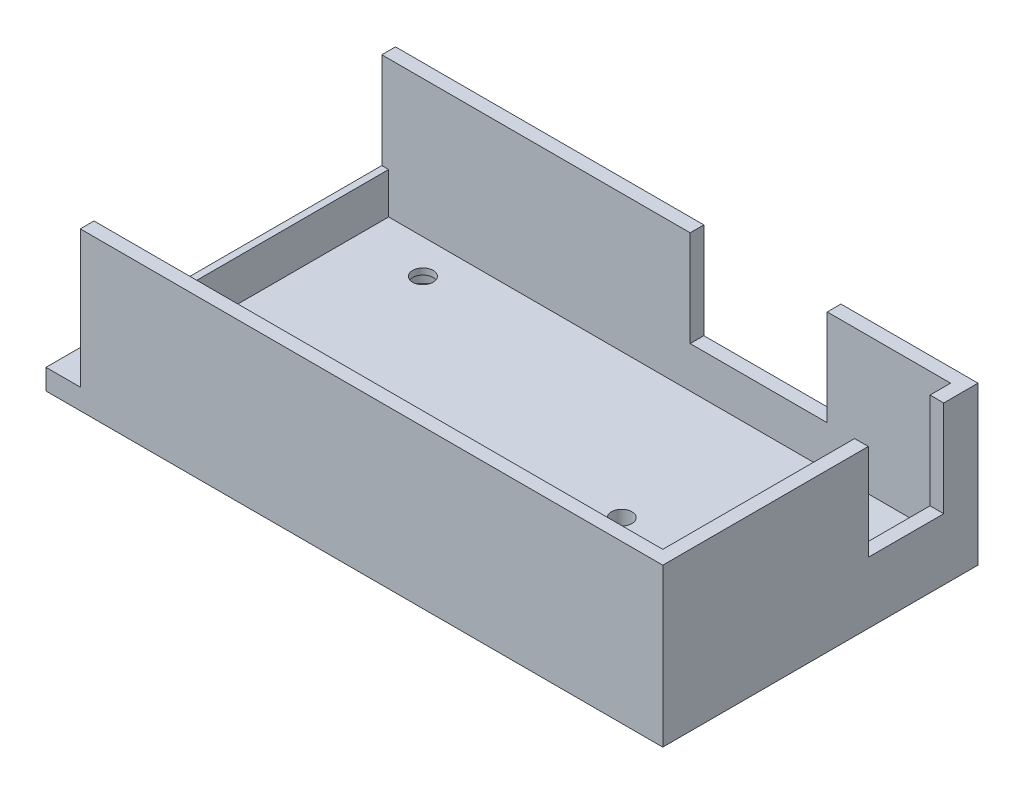
ISO-10303-21;
HEADER;
FILE_DESCRIPTION(('STEP AP214'),'2;1');
FILE_NAME('part.step','',(''),(''),'','','');
FILE_SCHEMA(('AUTOMOTIVE_DESIGN { 1 0 10303 214 1 1 1 1 }'));
ENDSEC;
DATA;
#1=APPLICATION_CONTEXT('core data for automotive mechanical design processes');
#2=APPLICATION_PROTOCOL_DEFINITION('international standard','automotive_design',2000,#1);
#3=PRODUCT_CONTEXT('',#1,'mechanical');
#4=PRODUCT('Part','Part','',(#3));
#5=PRODUCT_RELATED_PRODUCT_CATEGORY('part','',(#4));
#6=PRODUCT_DEFINITION_FORMATION('','',#4);
#7=PRODUCT_DEFINITION_CONTEXT('part definition',#1,'design');
#8=PRODUCT_DEFINITION('design','',#6,#7);
#9=PRODUCT_DEFINITION_SHAPE('','',#8);
#10=(LENGTH_UNIT() NAMED_UNIT(*) SI_UNIT(.MILLI.,.METRE.));
#11=(NAMED_UNIT(*) PLANE_ANGLE_UNIT() SI_UNIT($,.RADIAN.));
#12=(NAMED_UNIT(*) SI_UNIT($,.STERADIAN.) SOLID_ANGLE_UNIT());
#13=UNCERTAINTY_MEASURE_WITH_UNIT(LENGTH_MEASURE(1.E-05),#10,'distance_accuracy_value','');
#14=(GEOMETRIC_REPRESENTATION_CONTEXT(3) GLOBAL_UNCERTAINTY_ASSIGNED_CONTEXT((#13)) GLOBAL_UNIT_ASSIGNED_CONTEXT((#10,
#11,#12)) REPRESENTATION_CONTEXT('',''));
#15=CARTESIAN_POINT('',(0.,0.,0.));
#16=DIRECTION('',(0.,0.,1.));
#17=DIRECTION('',(1.,0.,0.));
#18=AXIS2_PLACEMENT_3D('',#15,#16,#17);
#19=CARTESIAN_POINT('',(0.,3.,0.));
#20=DIRECTION('',(0.,-1.,0.));
#21=DIRECTION('',(0.,0.,-1.));
#22=AXIS2_PLACEMENT_3D('',#19,#20,#21);
#23=PLANE('',#22);
#24=CARTESIAN_POINT('',(0.770894669395953,3.,10.2671371207063));
#25=DIRECTION('',(0.,1.,0.));
#26=DIRECTION('',(0.,0.,1.));
#27=AXIS2_PLACEMENT_3D('',#24,#25,#26);
#28=CIRCLE('',#27,1.5);
#29=CARTESIAN_POINT('',(0.770894669395953,3.,11.7671371207063));
#30=VERTEX_POINT('',#29);
#31=EDGE_CURVE('E368',#30,#30,#28,.T.);
#32=ORIENTED_EDGE('',*,*,#31,.F.);
#33=EDGE_LOOP('',(#32));
#34=FACE_BOUND('',#33,.T.);
#35=CARTESIAN_POINT('',(15.770894669396,3.,26.2671371207063));
#36=DIRECTION('',(0.,1.,0.));
#37=DIRECTION('',(0.,0.,1.));
#38=AXIS2_PLACEMENT_3D('',#35,#36,#37);
#39=CIRCLE('',#38,1.5);
#40=CARTESIAN_POINT('',(15.770894669396,3.,27.7671371207063));
#41=VERTEX_POINT('',#40);
#42=EDGE_CURVE('E274',#41,#41,#39,.T.);
#43=ORIENTED_EDGE('',*,*,#42,.F.);
#44=EDGE_LOOP('',(#43));
#45=FACE_BOUND('',#44,.T.);
#46=CARTESIAN_POINT('',(-44.229105330604,3.,-5.7328628792937));
#47=DIRECTION('',(0.,1.,0.));
#48=DIRECTION('',(0.,0.,1.));
#49=AXIS2_PLACEMENT_3D('',#46,#47,#48);
#50=CIRCLE('',#49,1.5);
#51=CARTESIAN_POINT('',(-44.229105330604,3.,-4.2328628792937));
#52=VERTEX_POINT('',#51);
#53=EDGE_CURVE('E267',#52,#52,#50,.T.);
#54=ORIENTED_EDGE('',*,*,#53,.F.);
#55=EDGE_LOOP('',(#54));
#56=FACE_BOUND('',#55,.T.);
#57=CARTESIAN_POINT('',(15.770894669396,3.,-5.7328628792937));
#58=DIRECTION('',(0.,1.,0.));
#59=DIRECTION('',(0.,0.,1.));
#60=AXIS2_PLACEMENT_3D('',#57,#58,#59);
#61=CIRCLE('',#60,1.5);
#62=CARTESIAN_POINT('',(15.770894669396,3.,-4.2328628792937));
#63=VERTEX_POINT('',#62);
#64=EDGE_CURVE('E270',#63,#63,#61,.T.);
#65=ORIENTED_EDGE('',*,*,#64,.F.);
#66=EDGE_LOOP('',(#65));
#67=FACE_BOUND('',#66,.T.);
#68=CARTESIAN_POINT('',(-44.229105330604,3.,26.2671371207063));
#69=DIRECTION('',(0.,1.,0.));
#70=DIRECTION('',(0.,0.,1.));
#71=AXIS2_PLACEMENT_3D('',#68,#69,#70);
#72=CIRCLE('',#71,1.5);
#73=CARTESIAN_POINT('',(-44.229105330604,3.,27.7671371207063));
#74=VERTEX_POINT('',#73);
#75=EDGE_CURVE('E271',#74,#74,#72,.T.);
#76=ORIENTED_EDGE('',*,*,#75,.F.);
#77=EDGE_LOOP('',(#76));
#78=FACE_BOUND('',#77,.T.);
#79=DIRECTION('',(0.,0.,-1.));
#80=VECTOR('',#79,1.);
#81=CARTESIAN_POINT('',(-54.229105330604,3.,31.2671371207063));
#82=LINE('',#81,#80);
#83=CARTESIAN_POINT('',(-54.229105330604,3.,31.2671371207063));
#84=VERTEX_POINT('',#83);
#85=CARTESIAN_POINT('',(-54.229105330604,3.,-10.7328628792937));
#86=VERTEX_POINT('',#85);
#87=EDGE_CURVE('E206',#84,#86,#82,.T.);
#88=ORIENTED_EDGE('',*,*,#87,.F.);
#89=DIRECTION('',(1.,0.,0.));
#90=VECTOR('',#89,1.);
#91=CARTESIAN_POINT('',(4.77089466939595,3.,31.2671371207063));
#92=LINE('',#91,#90);
#93=CARTESIAN_POINT('',(27.770894669396,3.,31.2671371207063));
#94=VERTEX_POINT('',#93);
#95=EDGE_CURVE('E284',#84,#94,#92,.T.);
#96=ORIENTED_EDGE('',*,*,#95,.T.);
#97=DIRECTION('',(0.,0.,-1.));
#98=VECTOR('',#97,1.);
#99=CARTESIAN_POINT('',(27.770894669396,3.,-7.7328628792937));
#100=LINE('',#99,#98);
#101=CARTESIAN_POINT('',(27.770894669396,3.,-10.7328628792937));
#102=VERTEX_POINT('',#101);
#103=EDGE_CURVE('E324',#94,#102,#100,.T.);
#104=ORIENTED_EDGE('',*,*,#103,.T.);
#105=DIRECTION('',(1.,0.,0.));
#106=VECTOR('',#105,1.);
#107=CARTESIAN_POINT('',(0.,3.,-10.7328628792937));
#108=LINE('',#107,#106);
#109=EDGE_CURVE('E338',#86,#102,#108,.T.);
#110=ORIENTED_EDGE('',*,*,#109,.F.);
#111=EDGE_LOOP('',(#88,#96,#104,#110));
#112=FACE_BOUND('',#111,.T.);
#113=ADVANCED_FACE('F59',(#34,#45,#56,#67,#78,#112),#23,.F.);
#114=CARTESIAN_POINT('',(-57.229105330604,3.,22.2671371207063));
#115=DIRECTION('',(0.,1.,0.));
#116=DIRECTION('',(0.,0.,1.));
#117=AXIS2_PLACEMENT_3D('',#114,#115,#116);
#118=CIRCLE('',#117,1.5);
#119=CARTESIAN_POINT('',(-57.229105330604,3.,23.7671371207063));
#120=VERTEX_POINT('',#119);
#121=EDGE_CURVE('E375',#120,#120,#118,.T.);
#122=ORIENTED_EDGE('',*,*,#121,.F.);
#123=EDGE_LOOP('',(#122));
#124=FACE_BOUND('',#123,.T.);
#125=CARTESIAN_POINT('',(-57.229105330604,3.,-1.7328628792937));
#126=DIRECTION('',(0.,1.,0.));
#127=DIRECTION('',(0.,0.,1.));
#128=AXIS2_PLACEMENT_3D('',#125,#126,#127);
#129=CIRCLE('',#128,1.5);
#130=CARTESIAN_POINT('',(-57.229105330604,3.,-0.232862879293695));
#131=VERTEX_POINT('',#130);
#132=EDGE_CURVE('E381',#131,#131,#129,.T.);
#133=ORIENTED_EDGE('',*,*,#132,.F.);
#134=EDGE_LOOP('',(#133));
#135=FACE_BOUND('',#134,.T.);
#136=DIRECTION('',(1.,0.,0.));
#137=VECTOR('',#136,1.);
#138=CARTESIAN_POINT('',(-60.229105330604,3.,33.2671371207063));
#139=LINE('',#138,#137);
#140=CARTESIAN_POINT('',(-60.229105330604,3.,33.2671371207063));
#141=VERTEX_POINT('',#140);
#142=CARTESIAN_POINT('',(-55.2291053306041,3.,33.2671371207063));
#143=VERTEX_POINT('',#142);
#144=EDGE_CURVE('E389',#141,#143,#139,.T.);
#145=ORIENTED_EDGE('',*,*,#144,.T.);
#146=DIRECTION('',(0.,0.,-1.));
#147=VECTOR('',#146,1.);
#148=CARTESIAN_POINT('',(-55.229105330604,3.,-10.7328628792937));
#149=LINE('',#148,#147);
#150=CARTESIAN_POINT('',(-55.229105330604,3.,-12.7328628792937));
#151=VERTEX_POINT('',#150);
#152=EDGE_CURVE('E322',#143,#151,#149,.T.);
#153=ORIENTED_EDGE('',*,*,#152,.T.);
#154=DIRECTION('',(1.,0.,0.));
#155=VECTOR('',#154,1.);
#156=CARTESIAN_POINT('',(-60.229105330604,3.,-12.7328628792937));
#157=LINE('',#156,#155);
#158=CARTESIAN_POINT('',(-60.229105330604,3.,-12.7328628792937));
#159=VERTEX_POINT('',#158);
#160=EDGE_CURVE('E392',#159,#151,#157,.T.);
#161=ORIENTED_EDGE('',*,*,#160,.F.);
#162=DIRECTION('',(0.,0.,1.));
#163=VECTOR('',#162,1.);
#164=CARTESIAN_POINT('',(-60.229105330604,3.,-12.7328628792937));
#165=LINE('',#164,#163);
#166=EDGE_CURVE('E396',#159,#141,#165,.T.);
#167=ORIENTED_EDGE('',*,*,#166,.T.);
#168=EDGE_LOOP('',(#145,#153,#161,#167));
#169=FACE_BOUND('',#168,.T.);
#170=ADVANCED_FACE('F444',(#124,#135,#169),#23,.F.);
#171=CARTESIAN_POINT('',(0.,23.,-10.7328628792937));
#172=DIRECTION('',(0.,0.,-1.));
#173=DIRECTION('',(-1.,0.,0.));
#174=AXIS2_PLACEMENT_3D('',#171,#172,#173);
#175=PLANE('',#174);
#176=DIRECTION('',(0.,-1.,0.));
#177=VECTOR('',#176,1.);
#178=CARTESIAN_POINT('',(-54.229105330604,9.,-10.7328628792937));
#179=LINE('',#178,#177);
#180=CARTESIAN_POINT('',(-54.229105330604,9.,-10.7328628792937));
#181=VERTEX_POINT('',#180);
#182=EDGE_CURVE('E209',#181,#86,#179,.T.);
#183=ORIENTED_EDGE('',*,*,#182,.T.);
#184=ORIENTED_EDGE('',*,*,#109,.T.);
#185=DIRECTION('',(0.,-1.,0.));
#186=VECTOR('',#185,1.);
#187=CARTESIAN_POINT('',(27.770894669396,23.,-10.7328628792937));
#188=LINE('',#187,#186);
#189=CARTESIAN_POINT('',(27.770894669396,23.,-10.7328628792937));
#190=VERTEX_POINT('',#189);
#191=EDGE_CURVE('E354',#190,#102,#188,.T.);
#192=ORIENTED_EDGE('',*,*,#191,.F.);
#193=DIRECTION('',(1.,0.,0.));
#194=VECTOR('',#193,1.);
#195=CARTESIAN_POINT('',(0.,23.,-10.7328628792937));
#196=LINE('',#195,#194);
#197=CARTESIAN_POINT('',(9.77089466939595,23.,-10.7328628792937));
#198=VERTEX_POINT('',#197);
#199=EDGE_CURVE('E337',#198,#190,#196,.T.);
#200=ORIENTED_EDGE('',*,*,#199,.F.);
#201=DIRECTION('',(0.,-1.,0.));
#202=VECTOR('',#201,1.);
#203=CARTESIAN_POINT('',(9.77089466939595,23.,-10.7328628792937));
#204=LINE('',#203,#202);
#205=CARTESIAN_POINT('',(9.77089466939595,9.,-10.7328628792937));
#206=VERTEX_POINT('',#205);
#207=EDGE_CURVE('E351',#198,#206,#204,.T.);
#208=ORIENTED_EDGE('',*,*,#207,.T.);
#209=DIRECTION('',(1.,0.,0.));
#210=VECTOR('',#209,1.);
#211=CARTESIAN_POINT('',(9.77089466939595,9.,-10.7328628792937));
#212=LINE('',#211,#210);
#213=CARTESIAN_POINT('',(-10.229105330604,9.,-10.7328628792937));
#214=VERTEX_POINT('',#213);
#215=EDGE_CURVE('E232',#214,#206,#212,.T.);
#216=ORIENTED_EDGE('',*,*,#215,.F.);
#217=DIRECTION('',(0.,-1.,0.));
#218=VECTOR('',#217,1.);
#219=CARTESIAN_POINT('',(-10.229105330604,23.,-10.7328628792937));
#220=LINE('',#219,#218);
#221=CARTESIAN_POINT('',(-10.229105330604,23.,-10.7328628792937));
#222=VERTEX_POINT('',#221);
#223=EDGE_CURVE('E300',#222,#214,#220,.T.);
#224=ORIENTED_EDGE('',*,*,#223,.F.);
#225=DIRECTION('',(1.,0.,0.));
#226=VECTOR('',#225,1.);
#227=CARTESIAN_POINT('',(-55.229105330604,23.,-10.7328628792937));
#228=LINE('',#227,#226);
#229=CARTESIAN_POINT('',(-55.229105330604,23.,-10.7328628792937));
#230=VERTEX_POINT('',#229);
#231=EDGE_CURVE('E325',#230,#222,#228,.T.);
#232=ORIENTED_EDGE('',*,*,#231,.F.);
#233=DIRECTION('',(0.,-1.,0.));
#234=VECTOR('',#233,1.);
#235=CARTESIAN_POINT('',(-55.229105330604,23.,-10.7328628792937));
#236=LINE('',#235,#234);
#237=CARTESIAN_POINT('',(-55.229105330604,9.,-10.7328628792937));
#238=VERTEX_POINT('',#237);
#239=EDGE_CURVE('E220',#230,#238,#236,.T.);
#240=ORIENTED_EDGE('',*,*,#239,.T.);
#241=DIRECTION('',(-1.,0.,0.));
#242=VECTOR('',#241,1.);
#243=CARTESIAN_POINT('',(-54.229105330604,9.,-10.7328628792937));
#244=LINE('',#243,#242);
#245=EDGE_CURVE('E200',#181,#238,#244,.T.);
#246=ORIENTED_EDGE('',*,*,#245,.F.);
#247=EDGE_LOOP('',(#183,#184,#192,#200,#208,#216,#224,#232,#240,#246));
#248=FACE_BOUND('',#247,.T.);
#249=ADVANCED_FACE('F218',(#248),#175,.F.);
#250=CARTESIAN_POINT('',(0.,23.,31.2671371207063));
#251=DIRECTION('',(0.,0.,-1.));
#252=DIRECTION('',(-1.,0.,0.));
#253=AXIS2_PLACEMENT_3D('',#250,#251,#252);
#254=PLANE('',#253);
#255=ORIENTED_EDGE('',*,*,#95,.F.);
#256=DIRECTION('',(0.,-1.,0.));
#257=VECTOR('',#256,1.);
#258=CARTESIAN_POINT('',(-54.229105330604,9.,31.2671371207063));
#259=LINE('',#258,#257);
#260=CARTESIAN_POINT('',(-54.229105330604,9.,31.2671371207063));
#261=VERTEX_POINT('',#260);
#262=EDGE_CURVE('E215',#261,#84,#259,.T.);
#263=ORIENTED_EDGE('',*,*,#262,.F.);
#264=DIRECTION('',(1.,0.,0.));
#265=VECTOR('',#264,1.);
#266=CARTESIAN_POINT('',(-54.229105330604,9.,31.2671371207063));
#267=LINE('',#266,#265);
#268=CARTESIAN_POINT('',(-55.229105330604,9.,31.2671371207063));
#269=VERTEX_POINT('',#268);
#270=EDGE_CURVE('E203',#269,#261,#267,.T.);
#271=ORIENTED_EDGE('',*,*,#270,.F.);
#272=DIRECTION('',(0.,-1.,0.));
#273=VECTOR('',#272,1.);
#274=CARTESIAN_POINT('',(-55.2291053306041,23.,31.2671371207063));
#275=LINE('',#274,#273);
#276=CARTESIAN_POINT('',(-55.2291053306041,23.,31.2671371207063));
#277=VERTEX_POINT('',#276);
#278=EDGE_CURVE('E279',#277,#269,#275,.T.);
#279=ORIENTED_EDGE('',*,*,#278,.F.);
#280=DIRECTION('',(1.,0.,0.));
#281=VECTOR('',#280,1.);
#282=CARTESIAN_POINT('',(4.77089466939595,23.,31.2671371207063));
#283=LINE('',#282,#281);
#284=CARTESIAN_POINT('',(27.770894669396,23.,31.2671371207063));
#285=VERTEX_POINT('',#284);
#286=EDGE_CURVE('E302',#277,#285,#283,.T.);
#287=ORIENTED_EDGE('',*,*,#286,.T.);
#288=DIRECTION('',(0.,-1.,0.));
#289=VECTOR('',#288,1.);
#290=CARTESIAN_POINT('',(27.770894669396,23.,31.2671371207063));
#291=LINE('',#290,#289);
#292=EDGE_CURVE('E288',#285,#94,#291,.T.);
#293=ORIENTED_EDGE('',*,*,#292,.T.);
#294=EDGE_LOOP('',(#255,#263,#271,#279,#287,#293));
#295=FACE_BOUND('',#294,.T.);
#296=ADVANCED_FACE('F429',(#295),#254,.T.);
#297=CARTESIAN_POINT('',(15.770894669396,0.,26.2671371207063));
#298=DIRECTION('',(0.,1.,0.));
#299=DIRECTION('',(0.,0.,1.));
#300=AXIS2_PLACEMENT_3D('',#297,#298,#299);
#301=CYLINDRICAL_SURFACE('',#300,1.5);
#302=ORIENTED_EDGE('',*,*,#42,.T.);
#303=EDGE_LOOP('',(#302));
#304=FACE_BOUND('',#303,.T.);
#305=CARTESIAN_POINT('',(15.770894669396,2.1,26.2671371207063));
#306=DIRECTION('',(0.,-1.,0.));
#307=DIRECTION('',(0.,0.,-1.));
#308=AXIS2_PLACEMENT_3D('',#305,#306,#307);
#309=CIRCLE('',#308,1.5);
#310=CARTESIAN_POINT('',(15.770894669396,2.1,24.7671371207063));
#311=VERTEX_POINT('',#310);
#312=EDGE_CURVE('E63',#311,#311,#309,.F.);
#313=ORIENTED_EDGE('',*,*,#312,.F.);
#314=EDGE_LOOP('',(#313));
#315=FACE_BOUND('',#314,.T.);
#316=ADVANCED_FACE('F426',(#304,#315),#301,.F.);
#317=CARTESIAN_POINT('',(-44.229105330604,0.,-5.7328628792937));
#318=DIRECTION('',(0.,1.,0.));
#319=DIRECTION('',(0.,0.,1.));
#320=AXIS2_PLACEMENT_3D('',#317,#318,#319);
#321=CYLINDRICAL_SURFACE('',#320,1.5);
#322=ORIENTED_EDGE('',*,*,#53,.T.);
#323=EDGE_LOOP('',(#322));
#324=FACE_BOUND('',#323,.T.);
#325=CARTESIAN_POINT('',(-44.229105330604,2.1,-5.7328628792937));
#326=DIRECTION('',(0.,-1.,0.));
#327=DIRECTION('',(0.,0.,-1.));
#328=AXIS2_PLACEMENT_3D('',#325,#326,#327);
#329=CIRCLE('',#328,1.5);
#330=CARTESIAN_POINT('',(-44.229105330604,2.1,-7.2328628792937));
#331=VERTEX_POINT('',#330);
#332=EDGE_CURVE('E417',#331,#331,#329,.F.);
#333=ORIENTED_EDGE('',*,*,#332,.F.);
#334=EDGE_LOOP('',(#333));
#335=FACE_BOUND('',#334,.T.);
#336=ADVANCED_FACE('F428',(#324,#335),#321,.F.);
#337=CARTESIAN_POINT('',(15.770894669396,0.,-5.7328628792937));
#338=DIRECTION('',(0.,1.,0.));
#339=DIRECTION('',(0.,0.,1.));
#340=AXIS2_PLACEMENT_3D('',#337,#338,#339);
#341=CYLINDRICAL_SURFACE('',#340,1.5);
#342=ORIENTED_EDGE('',*,*,#64,.T.);
#343=EDGE_LOOP('',(#342));
#344=FACE_BOUND('',#343,.T.);
#345=CARTESIAN_POINT('',(15.770894669396,2.1,-5.7328628792937));
#346=DIRECTION('',(0.,-1.,0.));
#347=DIRECTION('',(0.,0.,-1.));
#348=AXIS2_PLACEMENT_3D('',#345,#346,#347);
#349=CIRCLE('',#348,1.5);
#350=CARTESIAN_POINT('',(15.770894669396,2.1,-7.2328628792937));
#351=VERTEX_POINT('',#350);
#352=EDGE_CURVE('E415',#351,#351,#349,.F.);
#353=ORIENTED_EDGE('',*,*,#352,.F.);
#354=EDGE_LOOP('',(#353));
#355=FACE_BOUND('',#354,.T.);
#356=ADVANCED_FACE('F436',(#344,#355),#341,.F.);
#357=CARTESIAN_POINT('',(-44.229105330604,0.,26.2671371207063));
#358=DIRECTION('',(0.,1.,0.));
#359=DIRECTION('',(0.,0.,1.));
#360=AXIS2_PLACEMENT_3D('',#357,#358,#359);
#361=CYLINDRICAL_SURFACE('',#360,1.5);
#362=ORIENTED_EDGE('',*,*,#75,.T.);
#363=EDGE_LOOP('',(#362));
#364=FACE_BOUND('',#363,.T.);
#365=CARTESIAN_POINT('',(-44.229105330604,2.1,26.2671371207063));
#366=DIRECTION('',(0.,-1.,0.));
#367=DIRECTION('',(0.,0.,-1.));
#368=AXIS2_PLACEMENT_3D('',#365,#366,#367);
#369=CIRCLE('',#368,1.5);
#370=CARTESIAN_POINT('',(-44.229105330604,2.1,24.7671371207063));
#371=VERTEX_POINT('',#370);
#372=EDGE_CURVE('E264',#371,#371,#369,.F.);
#373=ORIENTED_EDGE('',*,*,#372,.F.);
#374=EDGE_LOOP('',(#373));
#375=FACE_BOUND('',#374,.T.);
#376=ADVANCED_FACE('F474',(#364,#375),#361,.F.);
#377=CARTESIAN_POINT('',(-60.229105330604,3.,33.2671371207063));
#378=DIRECTION('',(0.,0.,-1.));
#379=DIRECTION('',(-1.,0.,0.));
#380=AXIS2_PLACEMENT_3D('',#377,#378,#379);
#381=PLANE('',#380);
#382=DIRECTION('',(1.,0.,0.));
#383=VECTOR('',#382,1.);
#384=CARTESIAN_POINT('',(-60.229105330604,0.,33.2671371207063));
#385=LINE('',#384,#383);
#386=CARTESIAN_POINT('',(-60.229105330604,0.,33.2671371207063));
#387=VERTEX_POINT('',#386);
#388=CARTESIAN_POINT('',(29.770894669396,0.,33.2671371207063));
#389=VERTEX_POINT('',#388);
#390=EDGE_CURVE('E374',#387,#389,#385,.T.);
#391=ORIENTED_EDGE('',*,*,#390,.T.);
#392=DIRECTION('',(0.,-1.,0.));
#393=VECTOR('',#392,1.);
#394=CARTESIAN_POINT('',(29.770894669396,3.,33.2671371207063));
#395=LINE('',#394,#393);
#396=CARTESIAN_POINT('',(29.770894669396,23.,33.2671371207063));
#397=VERTEX_POINT('',#396);
#398=EDGE_CURVE('E12',#397,#389,#395,.T.);
#399=ORIENTED_EDGE('',*,*,#398,.F.);
#400=DIRECTION('',(1.,0.,0.));
#401=VECTOR('',#400,1.);
#402=CARTESIAN_POINT('',(4.77089466939595,23.,33.2671371207063));
#403=LINE('',#402,#401);
#404=CARTESIAN_POINT('',(-55.2291053306041,23.,33.2671371207063));
#405=VERTEX_POINT('',#404);
#406=EDGE_CURVE('E291',#405,#397,#403,.T.);
#407=ORIENTED_EDGE('',*,*,#406,.F.);
#408=DIRECTION('',(0.,-1.,0.));
#409=VECTOR('',#408,1.);
#410=CARTESIAN_POINT('',(-55.2291053306041,23.,33.2671371207063));
#411=LINE('',#410,#409);
#412=EDGE_CURVE('E309',#405,#143,#411,.T.);
#413=ORIENTED_EDGE('',*,*,#412,.T.);
#414=ORIENTED_EDGE('',*,*,#144,.F.);
#415=DIRECTION('',(0.,-1.,0.));
#416=VECTOR('',#415,1.);
#417=CARTESIAN_POINT('',(-60.229105330604,3.,33.2671371207063));
#418=LINE('',#417,#416);
#419=EDGE_CURVE('E398',#141,#387,#418,.T.);
#420=ORIENTED_EDGE('',*,*,#419,.T.);
#421=EDGE_LOOP('',(#391,#399,#407,#413,#414,#420));
#422=FACE_BOUND('',#421,.T.);
#423=ADVANCED_FACE('F61',(#422),#381,.F.);
#424=CARTESIAN_POINT('',(29.770894669396,3.,-12.7328628792937));
#425=DIRECTION('',(1.,0.,0.));
#426=DIRECTION('',(0.,0.,-1.));
#427=AXIS2_PLACEMENT_3D('',#424,#425,#426);
#428=PLANE('',#427);
#429=DIRECTION('',(0.,0.,1.));
#430=VECTOR('',#429,1.);
#431=CARTESIAN_POINT('',(29.770894669396,0.,-12.7328628792937));
#432=LINE('',#431,#430);
#433=CARTESIAN_POINT('',(29.770894669396,0.,-12.7328628792937));
#434=VERTEX_POINT('',#433);
#435=EDGE_CURVE('E401',#434,#389,#432,.T.);
#436=ORIENTED_EDGE('',*,*,#435,.F.);
#437=DIRECTION('',(0.,-1.,0.));
#438=VECTOR('',#437,1.);
#439=CARTESIAN_POINT('',(29.770894669396,3.,-12.7328628792937));
#440=LINE('',#439,#438);
#441=CARTESIAN_POINT('',(29.7708946693959,23.,-12.7328628792937));
#442=VERTEX_POINT('',#441);
#443=EDGE_CURVE('E68',#442,#434,#440,.T.);
#444=ORIENTED_EDGE('',*,*,#443,.F.);
#445=DIRECTION('',(0.,0.,-1.));
#446=VECTOR('',#445,1.);
#447=CARTESIAN_POINT('',(29.770894669396,23.,0.));
#448=LINE('',#447,#446);
#449=CARTESIAN_POINT('',(29.770894669396,23.,-7.7328628792937));
#450=VERTEX_POINT('',#449);
#451=EDGE_CURVE('E341',#450,#442,#448,.T.);
#452=ORIENTED_EDGE('',*,*,#451,.F.);
#453=DIRECTION('',(0.,-1.,0.));
#454=VECTOR('',#453,1.);
#455=CARTESIAN_POINT('',(29.770894669396,23.,-7.7328628792937));
#456=LINE('',#455,#454);
#457=CARTESIAN_POINT('',(29.770894669396,9.,-7.7328628792937));
#458=VERTEX_POINT('',#457);
#459=EDGE_CURVE('E348',#450,#458,#456,.T.);
#460=ORIENTED_EDGE('',*,*,#459,.T.);
#461=DIRECTION('',(0.,0.,-1.));
#462=VECTOR('',#461,1.);
#463=CARTESIAN_POINT('',(29.770894669396,9.,3.26713712070631));
#464=LINE('',#463,#462);
#465=CARTESIAN_POINT('',(29.770894669396,9.,3.26713712070631));
#466=VERTEX_POINT('',#465);
#467=EDGE_CURVE('E234',#466,#458,#464,.T.);
#468=ORIENTED_EDGE('',*,*,#467,.F.);
#469=DIRECTION('',(0.,-1.,0.));
#470=VECTOR('',#469,1.);
#471=CARTESIAN_POINT('',(29.770894669396,23.,3.26713712070631));
#472=LINE('',#471,#470);
#473=CARTESIAN_POINT('',(29.770894669396,23.,3.26713712070631));
#474=VERTEX_POINT('',#473);
#475=EDGE_CURVE('E280',#474,#466,#472,.T.);
#476=ORIENTED_EDGE('',*,*,#475,.F.);
#477=DIRECTION('',(0.,0.,-1.));
#478=VECTOR('',#477,1.);
#479=CARTESIAN_POINT('',(29.770894669396,23.,31.2671371207063));
#480=LINE('',#479,#478);
#481=EDGE_CURVE('E298',#397,#474,#480,.T.);
#482=ORIENTED_EDGE('',*,*,#481,.F.);
#483=ORIENTED_EDGE('',*,*,#398,.T.);
#484=EDGE_LOOP('',(#436,#444,#452,#460,#468,#476,#482,#483));
#485=FACE_BOUND('',#484,.T.);
#486=ADVANCED_FACE('F467',(#485),#428,.T.);
#487=CARTESIAN_POINT('',(-60.229105330604,3.,-12.7328628792937));
#488=DIRECTION('',(0.,0.,-1.));
#489=DIRECTION('',(-1.,0.,0.));
#490=AXIS2_PLACEMENT_3D('',#487,#488,#489);
#491=PLANE('',#490);
#492=DIRECTION('',(1.,0.,0.));
#493=VECTOR('',#492,1.);
#494=CARTESIAN_POINT('',(-60.229105330604,0.,-12.7328628792937));
#495=LINE('',#494,#493);
#496=CARTESIAN_POINT('',(-60.229105330604,0.,-12.7328628792937));
#497=VERTEX_POINT('',#496);
#498=EDGE_CURVE('E404',#497,#434,#495,.T.);
#499=ORIENTED_EDGE('',*,*,#498,.F.);
#500=DIRECTION('',(0.,-1.,0.));
#501=VECTOR('',#500,1.);
#502=CARTESIAN_POINT('',(-60.229105330604,3.,-12.7328628792937));
#503=LINE('',#502,#501);
#504=EDGE_CURVE('E410',#159,#497,#503,.T.);
#505=ORIENTED_EDGE('',*,*,#504,.F.);
#506=ORIENTED_EDGE('',*,*,#160,.T.);
#507=DIRECTION('',(0.,-1.,0.));
#508=VECTOR('',#507,1.);
#509=CARTESIAN_POINT('',(-55.229105330604,23.,-12.7328628792937));
#510=LINE('',#509,#508);
#511=CARTESIAN_POINT('',(-55.229105330604,23.,-12.7328628792937));
#512=VERTEX_POINT('',#511);
#513=EDGE_CURVE('E84',#512,#151,#510,.T.);
#514=ORIENTED_EDGE('',*,*,#513,.F.);
#515=DIRECTION('',(1.,0.,0.));
#516=VECTOR('',#515,1.);
#517=CARTESIAN_POINT('',(-55.229105330604,23.,-12.7328628792937));
#518=LINE('',#517,#516);
#519=CARTESIAN_POINT('',(-10.229105330604,23.,-12.7328628792937));
#520=VERTEX_POINT('',#519);
#521=EDGE_CURVE('E327',#512,#520,#518,.T.);
#522=ORIENTED_EDGE('',*,*,#521,.T.);
#523=DIRECTION('',(0.,-1.,0.));
#524=VECTOR('',#523,1.);
#525=CARTESIAN_POINT('',(-10.229105330604,23.,-12.7328628792937));
#526=LINE('',#525,#524);
#527=CARTESIAN_POINT('',(-10.229105330604,9.,-12.7328628792937));
#528=VERTEX_POINT('',#527);
#529=EDGE_CURVE('E316',#520,#528,#526,.T.);
#530=ORIENTED_EDGE('',*,*,#529,.T.);
#531=DIRECTION('',(-1.,0.,0.));
#532=VECTOR('',#531,1.);
#533=CARTESIAN_POINT('',(9.77089466939595,9.,-12.7328628792937));
#534=LINE('',#533,#532);
#535=CARTESIAN_POINT('',(9.77089466939595,9.,-12.7328628792937));
#536=VERTEX_POINT('',#535);
#537=EDGE_CURVE('E76',#536,#528,#534,.T.);
#538=ORIENTED_EDGE('',*,*,#537,.F.);
#539=DIRECTION('',(0.,-1.,0.));
#540=VECTOR('',#539,1.);
#541=CARTESIAN_POINT('',(9.77089466939595,23.,-12.7328628792937));
#542=LINE('',#541,#540);
#543=CARTESIAN_POINT('',(9.77089466939595,23.,-12.7328628792937));
#544=VERTEX_POINT('',#543);
#545=EDGE_CURVE('E346',#544,#536,#542,.T.);
#546=ORIENTED_EDGE('',*,*,#545,.F.);
#547=DIRECTION('',(-1.,0.,0.));
#548=VECTOR('',#547,1.);
#549=CARTESIAN_POINT('',(0.,23.,-12.7328628792937));
#550=LINE('',#549,#548);
#551=EDGE_CURVE('E344',#442,#544,#550,.T.);
#552=ORIENTED_EDGE('',*,*,#551,.F.);
#553=ORIENTED_EDGE('',*,*,#443,.T.);
#554=EDGE_LOOP('',(#499,#505,#506,#514,#522,#530,#538,#546,#552,#553));
#555=FACE_BOUND('',#554,.T.);
#556=ADVANCED_FACE('F464',(#555),#491,.T.);
#557=CARTESIAN_POINT('',(-60.229105330604,3.,-12.7328628792937));
#558=DIRECTION('',(1.,0.,0.));
#559=DIRECTION('',(0.,0.,-1.));
#560=AXIS2_PLACEMENT_3D('',#557,#558,#559);
#561=PLANE('',#560);
#562=DIRECTION('',(0.,0.,1.));
#563=VECTOR('',#562,1.);
#564=CARTESIAN_POINT('',(-60.229105330604,0.,-12.7328628792937));
#565=LINE('',#564,#563);
#566=EDGE_CURVE('E393',#497,#387,#565,.T.);
#567=ORIENTED_EDGE('',*,*,#566,.T.);
#568=ORIENTED_EDGE('',*,*,#419,.F.);
#569=ORIENTED_EDGE('',*,*,#166,.F.);
#570=ORIENTED_EDGE('',*,*,#504,.T.);
#571=EDGE_LOOP('',(#567,#568,#569,#570));
#572=FACE_BOUND('',#571,.T.);
#573=ADVANCED_FACE('F460',(#572),#561,.F.);
#574=CARTESIAN_POINT('',(0.,0.,0.));
#575=DIRECTION('',(0.,-1.,0.));
#576=DIRECTION('',(0.,0.,-1.));
#577=AXIS2_PLACEMENT_3D('',#574,#575,#576);
#578=PLANE('',#577);
#579=CARTESIAN_POINT('',(15.770894669396,0.,-5.7328628792937));
#580=DIRECTION('',(0.,-1.,0.));
#581=DIRECTION('',(0.,0.,-1.));
#582=AXIS2_PLACEMENT_3D('',#579,#580,#581);
#583=CIRCLE('',#582,3.);
#584=CARTESIAN_POINT('',(15.770894669396,0.,-8.7328628792937));
#585=VERTEX_POINT('',#584);
#586=EDGE_CURVE('E253',#585,#585,#583,.T.);
#587=ORIENTED_EDGE('',*,*,#586,.F.);
#588=EDGE_LOOP('',(#587));
#589=FACE_BOUND('',#588,.T.);
#590=CARTESIAN_POINT('',(-44.229105330604,0.,26.2671371207063));
#591=DIRECTION('',(0.,-1.,0.));
#592=DIRECTION('',(0.,0.,-1.));
#593=AXIS2_PLACEMENT_3D('',#590,#591,#592);
#594=CIRCLE('',#593,3.);
#595=CARTESIAN_POINT('',(-44.229105330604,0.,23.2671371207063));
#596=VERTEX_POINT('',#595);
#597=EDGE_CURVE('E246',#596,#596,#594,.T.);
#598=ORIENTED_EDGE('',*,*,#597,.F.);
#599=EDGE_LOOP('',(#598));
#600=FACE_BOUND('',#599,.T.);
#601=CARTESIAN_POINT('',(-44.229105330604,0.,-5.7328628792937));
#602=DIRECTION('',(0.,-1.,0.));
#603=DIRECTION('',(0.,0.,-1.));
#604=AXIS2_PLACEMENT_3D('',#601,#602,#603);
#605=CIRCLE('',#604,3.);
#606=CARTESIAN_POINT('',(-44.229105330604,0.,-8.7328628792937));
#607=VERTEX_POINT('',#606);
#608=EDGE_CURVE('E242',#607,#607,#605,.T.);
#609=ORIENTED_EDGE('',*,*,#608,.F.);
#610=EDGE_LOOP('',(#609));
#611=FACE_BOUND('',#610,.T.);
#612=CARTESIAN_POINT('',(15.770894669396,0.,26.2671371207063));
#613=DIRECTION('',(0.,-1.,0.));
#614=DIRECTION('',(0.,0.,-1.));
#615=AXIS2_PLACEMENT_3D('',#612,#613,#614);
#616=CIRCLE('',#615,3.);
#617=CARTESIAN_POINT('',(15.770894669396,0.,23.2671371207063));
#618=VERTEX_POINT('',#617);
#619=EDGE_CURVE('E252',#618,#618,#616,.T.);
#620=ORIENTED_EDGE('',*,*,#619,.F.);
#621=EDGE_LOOP('',(#620));
#622=FACE_BOUND('',#621,.T.);
#623=CARTESIAN_POINT('',(-57.229105330604,0.,22.2671371207063));
#624=DIRECTION('',(0.,1.,0.));
#625=DIRECTION('',(0.,0.,1.));
#626=AXIS2_PLACEMENT_3D('',#623,#624,#625);
#627=CIRCLE('',#626,1.5);
#628=CARTESIAN_POINT('',(-57.229105330604,0.,23.7671371207063));
#629=VERTEX_POINT('',#628);
#630=EDGE_CURVE('E371',#629,#629,#627,.T.);
#631=ORIENTED_EDGE('',*,*,#630,.T.);
#632=EDGE_LOOP('',(#631));
#633=FACE_BOUND('',#632,.T.);
#634=CARTESIAN_POINT('',(-57.229105330604,0.,-1.7328628792937));
#635=DIRECTION('',(0.,1.,0.));
#636=DIRECTION('',(0.,0.,1.));
#637=AXIS2_PLACEMENT_3D('',#634,#635,#636);
#638=CIRCLE('',#637,1.5);
#639=CARTESIAN_POINT('',(-57.229105330604,0.,-0.232862879293695));
#640=VERTEX_POINT('',#639);
#641=EDGE_CURVE('E378',#640,#640,#638,.T.);
#642=ORIENTED_EDGE('',*,*,#641,.T.);
#643=EDGE_LOOP('',(#642));
#644=FACE_BOUND('',#643,.T.);
#645=CARTESIAN_POINT('',(0.770894669395953,0.,10.2671371207063));
#646=DIRECTION('',(0.,1.,0.));
#647=DIRECTION('',(0.,0.,1.));
#648=AXIS2_PLACEMENT_3D('',#645,#646,#647);
#649=CIRCLE('',#648,1.5);
#650=CARTESIAN_POINT('',(0.770894669395953,0.,11.7671371207063));
#651=VERTEX_POINT('',#650);
#652=EDGE_CURVE('E384',#651,#651,#649,.T.);
#653=ORIENTED_EDGE('',*,*,#652,.T.);
#654=EDGE_LOOP('',(#653));
#655=FACE_BOUND('',#654,.T.);
#656=ORIENTED_EDGE('',*,*,#390,.F.);
#657=ORIENTED_EDGE('',*,*,#566,.F.);
#658=ORIENTED_EDGE('',*,*,#498,.T.);
#659=ORIENTED_EDGE('',*,*,#435,.T.);
#660=EDGE_LOOP('',(#656,#657,#658,#659));
#661=FACE_BOUND('',#660,.T.);
#662=ADVANCED_FACE('F457',(#589,#600,#611,#622,#633,#644,#655,#661),#578,.T.);
#663=CARTESIAN_POINT('',(0.770894669395953,0.,10.2671371207063));
#664=DIRECTION('',(0.,1.,0.));
#665=DIRECTION('',(0.,0.,1.));
#666=AXIS2_PLACEMENT_3D('',#663,#664,#665);
#667=CYLINDRICAL_SURFACE('',#666,1.5);
#668=ORIENTED_EDGE('',*,*,#652,.F.);
#669=EDGE_LOOP('',(#668));
#670=FACE_BOUND('',#669,.T.);
#671=ORIENTED_EDGE('',*,*,#31,.T.);
#672=EDGE_LOOP('',(#671));
#673=FACE_BOUND('',#672,.T.);
#674=ADVANCED_FACE('F455',(#670,#673),#667,.F.);
#675=CARTESIAN_POINT('',(-57.229105330604,0.,-1.7328628792937));
#676=DIRECTION('',(0.,1.,0.));
#677=DIRECTION('',(0.,0.,1.));
#678=AXIS2_PLACEMENT_3D('',#675,#676,#677);
#679=CYLINDRICAL_SURFACE('',#678,1.5);
#680=ORIENTED_EDGE('',*,*,#641,.F.);
#681=EDGE_LOOP('',(#680));
#682=FACE_BOUND('',#681,.T.);
#683=ORIENTED_EDGE('',*,*,#132,.T.);
#684=EDGE_LOOP('',(#683));
#685=FACE_BOUND('',#684,.T.);
#686=ADVANCED_FACE('F540',(#682,#685),#679,.F.);
#687=CARTESIAN_POINT('',(-57.229105330604,0.,22.2671371207063));
#688=DIRECTION('',(0.,1.,0.));
#689=DIRECTION('',(0.,0.,1.));
#690=AXIS2_PLACEMENT_3D('',#687,#688,#689);
#691=CYLINDRICAL_SURFACE('',#690,1.5);
#692=ORIENTED_EDGE('',*,*,#630,.F.);
#693=EDGE_LOOP('',(#692));
#694=FACE_BOUND('',#693,.T.);
#695=ORIENTED_EDGE('',*,*,#121,.T.);
#696=EDGE_LOOP('',(#695));
#697=FACE_BOUND('',#696,.T.);
#698=ADVANCED_FACE('F533',(#694,#697),#691,.F.);
#699=CARTESIAN_POINT('',(9.77089466939595,23.,0.));
#700=DIRECTION('',(-1.,0.,0.));
#701=DIRECTION('',(0.,0.,1.));
#702=AXIS2_PLACEMENT_3D('',#699,#700,#701);
#703=PLANE('',#702);
#704=DIRECTION('',(0.,0.,-1.));
#705=VECTOR('',#704,1.);
#706=CARTESIAN_POINT('',(9.77089466939595,9.,-10.7328628792937));
#707=LINE('',#706,#705);
#708=EDGE_CURVE('E214',#206,#536,#707,.T.);
#709=ORIENTED_EDGE('',*,*,#708,.F.);
#710=ORIENTED_EDGE('',*,*,#207,.F.);
#711=DIRECTION('',(0.,0.,-1.));
#712=VECTOR('',#711,1.);
#713=CARTESIAN_POINT('',(9.77089466939595,23.,0.));
#714=LINE('',#713,#712);
#715=EDGE_CURVE('E334',#198,#544,#714,.T.);
#716=ORIENTED_EDGE('',*,*,#715,.T.);
#717=ORIENTED_EDGE('',*,*,#545,.T.);
#718=EDGE_LOOP('',(#709,#710,#716,#717));
#719=FACE_BOUND('',#718,.T.);
#720=ADVANCED_FACE('F527',(#719),#703,.T.);
#721=CARTESIAN_POINT('',(0.,23.,0.));
#722=DIRECTION('',(0.,1.,0.));
#723=DIRECTION('',(0.,0.,1.));
#724=AXIS2_PLACEMENT_3D('',#721,#722,#723);
#725=PLANE('',#724);
#726=ORIENTED_EDGE('',*,*,#715,.F.);
#727=ORIENTED_EDGE('',*,*,#199,.T.);
#728=DIRECTION('',(0.,0.,-1.));
#729=VECTOR('',#728,1.);
#730=CARTESIAN_POINT('',(27.770894669396,23.,-7.7328628792937));
#731=LINE('',#730,#729);
#732=CARTESIAN_POINT('',(27.770894669396,23.,-7.7328628792937));
#733=VERTEX_POINT('',#732);
#734=EDGE_CURVE('E358',#733,#190,#731,.T.);
#735=ORIENTED_EDGE('',*,*,#734,.F.);
#736=DIRECTION('',(1.,0.,0.));
#737=VECTOR('',#736,1.);
#738=CARTESIAN_POINT('',(27.770894669396,23.,-7.7328628792937));
#739=LINE('',#738,#737);
#740=EDGE_CURVE('E355',#733,#450,#739,.T.);
#741=ORIENTED_EDGE('',*,*,#740,.T.);
#742=ORIENTED_EDGE('',*,*,#451,.T.);
#743=ORIENTED_EDGE('',*,*,#551,.T.);
#744=EDGE_LOOP('',(#726,#727,#735,#741,#742,#743));
#745=FACE_BOUND('',#744,.T.);
#746=ADVANCED_FACE('F487',(#745),#725,.T.);
#747=CARTESIAN_POINT('',(27.770894669396,23.,-7.7328628792937));
#748=DIRECTION('',(0.,0.,-1.));
#749=DIRECTION('',(-1.,0.,0.));
#750=AXIS2_PLACEMENT_3D('',#747,#748,#749);
#751=PLANE('',#750);
#752=DIRECTION('',(0.,-1.,0.));
#753=VECTOR('',#752,1.);
#754=CARTESIAN_POINT('',(27.770894669396,23.,-7.7328628792937));
#755=LINE('',#754,#753);
#756=CARTESIAN_POINT('',(27.770894669396,9.,-7.7328628792937));
#757=VERTEX_POINT('',#756);
#758=EDGE_CURVE('E361',#733,#757,#755,.T.);
#759=ORIENTED_EDGE('',*,*,#758,.T.);
#760=DIRECTION('',(-1.,0.,0.));
#761=VECTOR('',#760,1.);
#762=CARTESIAN_POINT('',(29.770894669396,9.,-7.7328628792937));
#763=LINE('',#762,#761);
#764=EDGE_CURVE('E236',#458,#757,#763,.T.);
#765=ORIENTED_EDGE('',*,*,#764,.F.);
#766=ORIENTED_EDGE('',*,*,#459,.F.);
#767=ORIENTED_EDGE('',*,*,#740,.F.);
#768=EDGE_LOOP('',(#759,#765,#766,#767));
#769=FACE_BOUND('',#768,.T.);
#770=ADVANCED_FACE('F495',(#769),#751,.F.);
#771=CARTESIAN_POINT('',(27.770894669396,23.,-7.7328628792937));
#772=DIRECTION('',(-1.,0.,0.));
#773=DIRECTION('',(0.,0.,1.));
#774=AXIS2_PLACEMENT_3D('',#771,#772,#773);
#775=PLANE('',#774);
#776=ORIENTED_EDGE('',*,*,#103,.F.);
#777=ORIENTED_EDGE('',*,*,#292,.F.);
#778=DIRECTION('',(0.,0.,-1.));
#779=VECTOR('',#778,1.);
#780=CARTESIAN_POINT('',(27.770894669396,23.,31.2671371207063));
#781=LINE('',#780,#779);
#782=CARTESIAN_POINT('',(27.770894669396,23.,3.26713712070631));
#783=VERTEX_POINT('',#782);
#784=EDGE_CURVE('E287',#285,#783,#781,.T.);
#785=ORIENTED_EDGE('',*,*,#784,.T.);
#786=DIRECTION('',(0.,-1.,0.));
#787=VECTOR('',#786,1.);
#788=CARTESIAN_POINT('',(27.770894669396,23.,3.26713712070631));
#789=LINE('',#788,#787);
#790=CARTESIAN_POINT('',(27.770894669396,9.,3.26713712070631));
#791=VERTEX_POINT('',#790);
#792=EDGE_CURVE('E283',#783,#791,#789,.T.);
#793=ORIENTED_EDGE('',*,*,#792,.T.);
#794=DIRECTION('',(0.,0.,1.));
#795=VECTOR('',#794,1.);
#796=CARTESIAN_POINT('',(27.770894669396,9.,3.26713712070631));
#797=LINE('',#796,#795);
#798=EDGE_CURVE('E238',#757,#791,#797,.T.);
#799=ORIENTED_EDGE('',*,*,#798,.F.);
#800=ORIENTED_EDGE('',*,*,#758,.F.);
#801=ORIENTED_EDGE('',*,*,#734,.T.);
#802=ORIENTED_EDGE('',*,*,#191,.T.);
#803=EDGE_LOOP('',(#776,#777,#785,#793,#799,#800,#801,#802));
#804=FACE_BOUND('',#803,.T.);
#805=ADVANCED_FACE('F502',(#804),#775,.T.);
#806=CARTESIAN_POINT('',(-10.229105330604,23.,-10.7328628792937));
#807=DIRECTION('',(-1.,0.,0.));
#808=DIRECTION('',(0.,0.,1.));
#809=AXIS2_PLACEMENT_3D('',#806,#807,#808);
#810=PLANE('',#809);
#811=ORIENTED_EDGE('',*,*,#223,.T.);
#812=DIRECTION('',(0.,0.,1.));
#813=VECTOR('',#812,1.);
#814=CARTESIAN_POINT('',(-10.229105330604,9.,-10.7328628792937));
#815=LINE('',#814,#813);
#816=EDGE_CURVE('E230',#528,#214,#815,.T.);
#817=ORIENTED_EDGE('',*,*,#816,.F.);
#818=ORIENTED_EDGE('',*,*,#529,.F.);
#819=DIRECTION('',(0.,0.,-1.));
#820=VECTOR('',#819,1.);
#821=CARTESIAN_POINT('',(-10.229105330604,23.,-10.7328628792937));
#822=LINE('',#821,#820);
#823=EDGE_CURVE('E330',#222,#520,#822,.T.);
#824=ORIENTED_EDGE('',*,*,#823,.F.);
#825=EDGE_LOOP('',(#811,#817,#818,#824));
#826=FACE_BOUND('',#825,.T.);
#827=ADVANCED_FACE('F523',(#826),#810,.F.);
#828=CARTESIAN_POINT('',(-55.229105330604,23.,-10.7328628792937));
#829=DIRECTION('',(-1.,0.,0.));
#830=DIRECTION('',(0.,0.,1.));
#831=AXIS2_PLACEMENT_3D('',#828,#829,#830);
#832=PLANE('',#831);
#833=ORIENTED_EDGE('',*,*,#152,.F.);
#834=ORIENTED_EDGE('',*,*,#412,.F.);
#835=DIRECTION('',(0.,0.,-1.));
#836=VECTOR('',#835,1.);
#837=CARTESIAN_POINT('',(-55.2291053306041,23.,0.));
#838=LINE('',#837,#836);
#839=EDGE_CURVE('E292',#405,#277,#838,.T.);
#840=ORIENTED_EDGE('',*,*,#839,.T.);
#841=ORIENTED_EDGE('',*,*,#278,.T.);
#842=DIRECTION('',(0.,0.,1.));
#843=VECTOR('',#842,1.);
#844=CARTESIAN_POINT('',(-55.229105330604,9.,31.2671371207063));
#845=LINE('',#844,#843);
#846=EDGE_CURVE('E221',#238,#269,#845,.T.);
#847=ORIENTED_EDGE('',*,*,#846,.F.);
#848=ORIENTED_EDGE('',*,*,#239,.F.);
#849=DIRECTION('',(0.,0.,-1.));
#850=VECTOR('',#849,1.);
#851=CARTESIAN_POINT('',(-55.229105330604,23.,-10.7328628792937));
#852=LINE('',#851,#850);
#853=EDGE_CURVE('E321',#230,#512,#852,.T.);
#854=ORIENTED_EDGE('',*,*,#853,.T.);
#855=ORIENTED_EDGE('',*,*,#513,.T.);
#856=EDGE_LOOP('',(#833,#834,#840,#841,#847,#848,#854,#855));
#857=FACE_BOUND('',#856,.T.);
#858=ADVANCED_FACE('F512',(#857),#832,.T.);
#859=CARTESIAN_POINT('',(0.,23.,0.));
#860=DIRECTION('',(0.,1.,0.));
#861=DIRECTION('',(0.,0.,1.));
#862=AXIS2_PLACEMENT_3D('',#859,#860,#861);
#863=PLANE('',#862);
#864=ORIENTED_EDGE('',*,*,#231,.T.);
#865=ORIENTED_EDGE('',*,*,#823,.T.);
#866=ORIENTED_EDGE('',*,*,#521,.F.);
#867=ORIENTED_EDGE('',*,*,#853,.F.);
#868=EDGE_LOOP('',(#864,#865,#866,#867));
#869=FACE_BOUND('',#868,.T.);
#870=ADVANCED_FACE('F518',(#869),#863,.T.);
#871=CARTESIAN_POINT('',(0.,23.,0.));
#872=DIRECTION('',(0.,1.,0.));
#873=DIRECTION('',(0.,0.,1.));
#874=AXIS2_PLACEMENT_3D('',#871,#872,#873);
#875=PLANE('',#874);
#876=ORIENTED_EDGE('',*,*,#286,.F.);
#877=ORIENTED_EDGE('',*,*,#839,.F.);
#878=ORIENTED_EDGE('',*,*,#406,.T.);
#879=ORIENTED_EDGE('',*,*,#481,.T.);
#880=DIRECTION('',(1.,0.,0.));
#881=VECTOR('',#880,1.);
#882=CARTESIAN_POINT('',(27.770894669396,23.,3.26713712070631));
#883=LINE('',#882,#881);
#884=EDGE_CURVE('E295',#783,#474,#883,.T.);
#885=ORIENTED_EDGE('',*,*,#884,.F.);
#886=ORIENTED_EDGE('',*,*,#784,.F.);
#887=EDGE_LOOP('',(#876,#877,#878,#879,#885,#886));
#888=FACE_BOUND('',#887,.T.);
#889=ADVANCED_FACE('F508',(#888),#875,.T.);
#890=CARTESIAN_POINT('',(27.770894669396,23.,3.26713712070631));
#891=DIRECTION('',(0.,0.,-1.));
#892=DIRECTION('',(-1.,0.,0.));
#893=AXIS2_PLACEMENT_3D('',#890,#891,#892);
#894=PLANE('',#893);
#895=DIRECTION('',(1.,0.,0.));
#896=VECTOR('',#895,1.);
#897=CARTESIAN_POINT('',(29.770894669396,9.,3.26713712070631));
#898=LINE('',#897,#896);
#899=EDGE_CURVE('E240',#791,#466,#898,.T.);
#900=ORIENTED_EDGE('',*,*,#899,.F.);
#901=ORIENTED_EDGE('',*,*,#792,.F.);
#902=ORIENTED_EDGE('',*,*,#884,.T.);
#903=ORIENTED_EDGE('',*,*,#475,.T.);
#904=EDGE_LOOP('',(#900,#901,#902,#903));
#905=FACE_BOUND('',#904,.T.);
#906=ADVANCED_FACE('F506',(#905),#894,.T.);
#907=CARTESIAN_POINT('',(-44.229105330604,2.1,26.2671371207063));
#908=DIRECTION('',(0.,-1.,0.));
#909=DIRECTION('',(0.,0.,-1.));
#910=AXIS2_PLACEMENT_3D('',#907,#908,#909);
#911=PLANE('',#910);
#912=CARTESIAN_POINT('',(-44.229105330604,2.1,26.2671371207063));
#913=DIRECTION('',(0.,-1.,0.));
#914=DIRECTION('',(0.,0.,-1.));
#915=AXIS2_PLACEMENT_3D('',#912,#913,#914);
#916=CIRCLE('',#915,3.);
#917=CARTESIAN_POINT('',(-44.229105330604,2.1,23.2671371207063));
#918=VERTEX_POINT('',#917);
#919=EDGE_CURVE('E256',#918,#918,#916,.T.);
#920=ORIENTED_EDGE('',*,*,#919,.T.);
#921=EDGE_LOOP('',(#920));
#922=FACE_BOUND('',#921,.T.);
#923=ORIENTED_EDGE('',*,*,#372,.T.);
#924=EDGE_LOOP('',(#923));
#925=FACE_BOUND('',#924,.T.);
#926=ADVANCED_FACE('F631',(#922,#925),#911,.T.);
#927=CARTESIAN_POINT('',(-44.229105330604,2.1,26.2671371207063));
#928=DIRECTION('',(0.,-1.,0.));
#929=DIRECTION('',(0.,0.,-1.));
#930=AXIS2_PLACEMENT_3D('',#927,#928,#929);
#931=CYLINDRICAL_SURFACE('',#930,3.);
#932=ORIENTED_EDGE('',*,*,#919,.F.);
#933=EDGE_LOOP('',(#932));
#934=FACE_BOUND('',#933,.T.);
#935=ORIENTED_EDGE('',*,*,#597,.T.);
#936=EDGE_LOOP('',(#935));
#937=FACE_BOUND('',#936,.T.);
#938=ADVANCED_FACE('F684',(#934,#937),#931,.F.);
#939=CARTESIAN_POINT('',(15.770894669396,2.1,-5.7328628792937));
#940=DIRECTION('',(0.,-1.,0.));
#941=DIRECTION('',(0.,0.,-1.));
#942=AXIS2_PLACEMENT_3D('',#939,#940,#941);
#943=PLANE('',#942);
#944=CARTESIAN_POINT('',(15.770894669396,2.1,-5.7328628792937));
#945=DIRECTION('',(0.,-1.,0.));
#946=DIRECTION('',(0.,0.,-1.));
#947=AXIS2_PLACEMENT_3D('',#944,#945,#946);
#948=CIRCLE('',#947,3.);
#949=CARTESIAN_POINT('',(15.770894669396,2.1,-8.7328628792937));
#950=VERTEX_POINT('',#949);
#951=EDGE_CURVE('E249',#950,#950,#948,.T.);
#952=ORIENTED_EDGE('',*,*,#951,.T.);
#953=EDGE_LOOP('',(#952));
#954=FACE_BOUND('',#953,.T.);
#955=ORIENTED_EDGE('',*,*,#352,.T.);
#956=EDGE_LOOP('',(#955));
#957=FACE_BOUND('',#956,.T.);
#958=ADVANCED_FACE('F681',(#954,#957),#943,.T.);
#959=CARTESIAN_POINT('',(15.770894669396,2.1,-5.7328628792937));
#960=DIRECTION('',(0.,-1.,0.));
#961=DIRECTION('',(0.,0.,-1.));
#962=AXIS2_PLACEMENT_3D('',#959,#960,#961);
#963=CYLINDRICAL_SURFACE('',#962,3.);
#964=ORIENTED_EDGE('',*,*,#951,.F.);
#965=EDGE_LOOP('',(#964));
#966=FACE_BOUND('',#965,.T.);
#967=ORIENTED_EDGE('',*,*,#586,.T.);
#968=EDGE_LOOP('',(#967));
#969=FACE_BOUND('',#968,.T.);
#970=ADVANCED_FACE('F676',(#966,#969),#963,.F.);
#971=CARTESIAN_POINT('',(-44.229105330604,2.1,-5.7328628792937));
#972=DIRECTION('',(0.,-1.,0.));
#973=DIRECTION('',(0.,0.,-1.));
#974=AXIS2_PLACEMENT_3D('',#971,#972,#973);
#975=PLANE('',#974);
#976=CARTESIAN_POINT('',(-44.229105330604,2.1,-5.7328628792937));
#977=DIRECTION('',(0.,-1.,0.));
#978=DIRECTION('',(0.,0.,-1.));
#979=AXIS2_PLACEMENT_3D('',#976,#977,#978);
#980=CIRCLE('',#979,3.);
#981=CARTESIAN_POINT('',(-44.229105330604,2.1,-8.7328628792937));
#982=VERTEX_POINT('',#981);
#983=EDGE_CURVE('E243',#982,#982,#980,.T.);
#984=ORIENTED_EDGE('',*,*,#983,.T.);
#985=EDGE_LOOP('',(#984));
#986=FACE_BOUND('',#985,.T.);
#987=ORIENTED_EDGE('',*,*,#332,.T.);
#988=EDGE_LOOP('',(#987));
#989=FACE_BOUND('',#988,.T.);
#990=ADVANCED_FACE('F672',(#986,#989),#975,.T.);
#991=CARTESIAN_POINT('',(-44.229105330604,2.1,-5.7328628792937));
#992=DIRECTION('',(0.,-1.,0.));
#993=DIRECTION('',(0.,0.,-1.));
#994=AXIS2_PLACEMENT_3D('',#991,#992,#993);
#995=CYLINDRICAL_SURFACE('',#994,3.);
#996=ORIENTED_EDGE('',*,*,#983,.F.);
#997=EDGE_LOOP('',(#996));
#998=FACE_BOUND('',#997,.T.);
#999=ORIENTED_EDGE('',*,*,#608,.T.);
#1000=EDGE_LOOP('',(#999));
#1001=FACE_BOUND('',#1000,.T.);
#1002=ADVANCED_FACE('F675',(#998,#1001),#995,.F.);
#1003=CARTESIAN_POINT('',(15.770894669396,2.1,26.2671371207063));
#1004=DIRECTION('',(0.,-1.,0.));
#1005=DIRECTION('',(0.,0.,-1.));
#1006=AXIS2_PLACEMENT_3D('',#1003,#1004,#1005);
#1007=PLANE('',#1006);
#1008=CARTESIAN_POINT('',(15.770894669396,2.1,26.2671371207063));
#1009=DIRECTION('',(0.,-1.,0.));
#1010=DIRECTION('',(0.,0.,-1.));
#1011=AXIS2_PLACEMENT_3D('',#1008,#1009,#1010);
#1012=CIRCLE('',#1011,3.);
#1013=CARTESIAN_POINT('',(15.770894669396,2.1,23.2671371207063));
#1014=VERTEX_POINT('',#1013);
#1015=EDGE_CURVE('E261',#1014,#1014,#1012,.T.);
#1016=ORIENTED_EDGE('',*,*,#1015,.T.);
#1017=EDGE_LOOP('',(#1016));
#1018=FACE_BOUND('',#1017,.T.);
#1019=ORIENTED_EDGE('',*,*,#312,.T.);
#1020=EDGE_LOOP('',(#1019));
#1021=FACE_BOUND('',#1020,.T.);
#1022=ADVANCED_FACE('F424',(#1018,#1021),#1007,.T.);
#1023=CARTESIAN_POINT('',(15.770894669396,2.1,26.2671371207063));
#1024=DIRECTION('',(0.,-1.,0.));
#1025=DIRECTION('',(0.,0.,-1.));
#1026=AXIS2_PLACEMENT_3D('',#1023,#1024,#1025);
#1027=CYLINDRICAL_SURFACE('',#1026,3.);
#1028=ORIENTED_EDGE('',*,*,#1015,.F.);
#1029=EDGE_LOOP('',(#1028));
#1030=FACE_BOUND('',#1029,.T.);
#1031=ORIENTED_EDGE('',*,*,#619,.T.);
#1032=EDGE_LOOP('',(#1031));
#1033=FACE_BOUND('',#1032,.T.);
#1034=ADVANCED_FACE('F642',(#1030,#1033),#1027,.F.);
#1035=CARTESIAN_POINT('',(0.,9.,0.));
#1036=DIRECTION('',(0.,1.,0.));
#1037=DIRECTION('',(0.,0.,1.));
#1038=AXIS2_PLACEMENT_3D('',#1035,#1036,#1037);
#1039=PLANE('',#1038);
#1040=ORIENTED_EDGE('',*,*,#467,.T.);
#1041=ORIENTED_EDGE('',*,*,#764,.T.);
#1042=ORIENTED_EDGE('',*,*,#798,.T.);
#1043=ORIENTED_EDGE('',*,*,#899,.T.);
#1044=EDGE_LOOP('',(#1040,#1041,#1042,#1043));
#1045=FACE_BOUND('',#1044,.T.);
#1046=ADVANCED_FACE('F498',(#1045),#1039,.T.);
#1047=CARTESIAN_POINT('',(0.,9.,0.));
#1048=DIRECTION('',(0.,1.,0.));
#1049=DIRECTION('',(0.,0.,1.));
#1050=AXIS2_PLACEMENT_3D('',#1047,#1048,#1049);
#1051=PLANE('',#1050);
#1052=ORIENTED_EDGE('',*,*,#708,.T.);
#1053=ORIENTED_EDGE('',*,*,#537,.T.);
#1054=ORIENTED_EDGE('',*,*,#816,.T.);
#1055=ORIENTED_EDGE('',*,*,#215,.T.);
#1056=EDGE_LOOP('',(#1052,#1053,#1054,#1055));
#1057=FACE_BOUND('',#1056,.T.);
#1058=ADVANCED_FACE('F525',(#1057),#1051,.T.);
#1059=CARTESIAN_POINT('',(-54.229105330604,9.,31.2671371207063));
#1060=DIRECTION('',(-1.,0.,0.));
#1061=DIRECTION('',(0.,0.,1.));
#1062=AXIS2_PLACEMENT_3D('',#1059,#1060,#1061);
#1063=PLANE('',#1062);
#1064=ORIENTED_EDGE('',*,*,#87,.T.);
#1065=ORIENTED_EDGE('',*,*,#182,.F.);
#1066=DIRECTION('',(0.,0.,-1.));
#1067=VECTOR('',#1066,1.);
#1068=CARTESIAN_POINT('',(-54.229105330604,9.,31.2671371207063));
#1069=LINE('',#1068,#1067);
#1070=EDGE_CURVE('E196',#261,#181,#1069,.T.);
#1071=ORIENTED_EDGE('',*,*,#1070,.F.);
#1072=ORIENTED_EDGE('',*,*,#262,.T.);
#1073=EDGE_LOOP('',(#1064,#1065,#1071,#1072));
#1074=FACE_BOUND('',#1073,.T.);
#1075=ADVANCED_FACE('F210',(#1074),#1063,.F.);
#1076=CARTESIAN_POINT('',(0.,9.,0.));
#1077=DIRECTION('',(0.,1.,0.));
#1078=DIRECTION('',(0.,0.,1.));
#1079=AXIS2_PLACEMENT_3D('',#1076,#1077,#1078);
#1080=PLANE('',#1079);
#1081=ORIENTED_EDGE('',*,*,#1070,.T.);
#1082=ORIENTED_EDGE('',*,*,#245,.T.);
#1083=ORIENTED_EDGE('',*,*,#846,.T.);
#1084=ORIENTED_EDGE('',*,*,#270,.T.);
#1085=EDGE_LOOP('',(#1081,#1082,#1083,#1084));
#1086=FACE_BOUND('',#1085,.T.);
#1087=ADVANCED_FACE('F198',(#1086),#1080,.T.);
#1088=CLOSED_SHELL('',(#113,#170,#249,#296,#316,#336,#356,#376,#423,#486,#556,#573,#662,#674,
#686,#698,#720,#746,#770,#805,#827,#858,#870,#889,#906,#926,#938,#958,#970,#990,#1002,#1022,
#1034,#1046,#1058,#1075,#1087));
#1089=MANIFOLD_SOLID_BREP('B2',#1088);
#1090=ADVANCED_BREP_SHAPE_REPRESENTATION('',(#18,#1089),#14);
#1091=SHAPE_DEFINITION_REPRESENTATION(#9,#1090);
ENDSEC;
END-ISO-10303-21;
